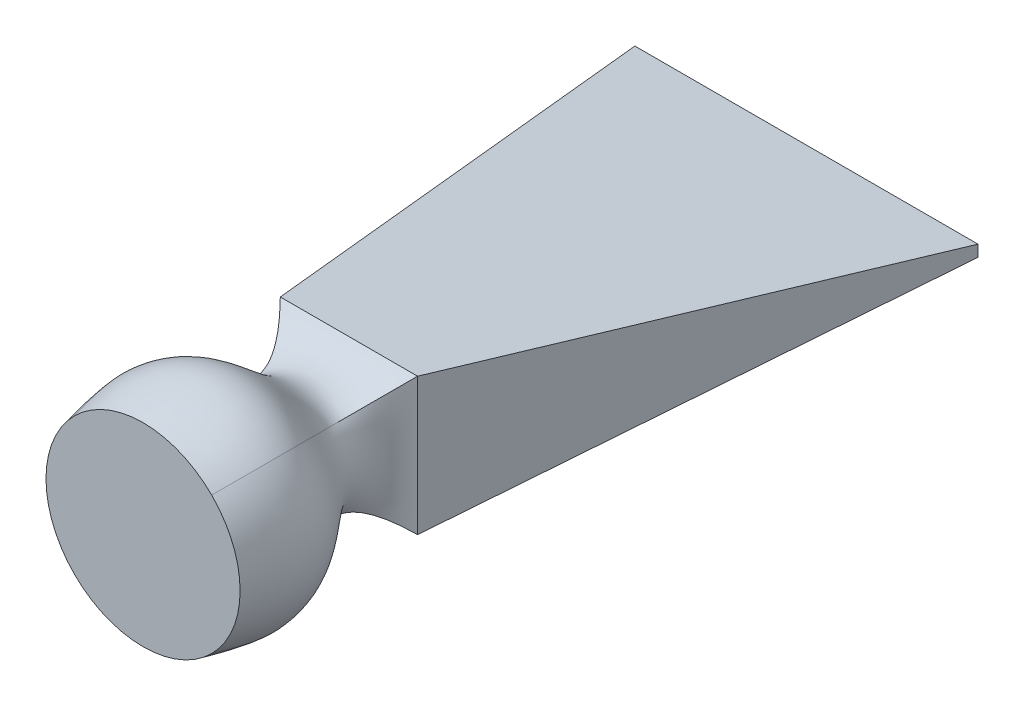
ISO-10303-21;
HEADER;
FILE_DESCRIPTION(('STEP AP214'),'2;1');
FILE_NAME('part.step','',(''),(''),'','','');
FILE_SCHEMA(('AUTOMOTIVE_DESIGN { 1 0 10303 214 1 1 1 1 }'));
ENDSEC;
DATA;
#1=APPLICATION_CONTEXT('core data for automotive mechanical design processes');
#2=APPLICATION_PROTOCOL_DEFINITION('international standard','automotive_design',2000,#1);
#3=PRODUCT_CONTEXT('',#1,'mechanical');
#4=PRODUCT('Part','Part','',(#3));
#5=PRODUCT_RELATED_PRODUCT_CATEGORY('part','',(#4));
#6=PRODUCT_DEFINITION_FORMATION('','',#4);
#7=PRODUCT_DEFINITION_CONTEXT('part definition',#1,'design');
#8=PRODUCT_DEFINITION('design','',#6,#7);
#9=PRODUCT_DEFINITION_SHAPE('','',#8);
#10=(LENGTH_UNIT() NAMED_UNIT(*) SI_UNIT(.MILLI.,.METRE.));
#11=(NAMED_UNIT(*) PLANE_ANGLE_UNIT() SI_UNIT($,.RADIAN.));
#12=(NAMED_UNIT(*) SI_UNIT($,.STERADIAN.) SOLID_ANGLE_UNIT());
#13=UNCERTAINTY_MEASURE_WITH_UNIT(LENGTH_MEASURE(1.E-05),#10,'distance_accuracy_value','');
#14=(GEOMETRIC_REPRESENTATION_CONTEXT(3) GLOBAL_UNCERTAINTY_ASSIGNED_CONTEXT((#13)) GLOBAL_UNIT_ASSIGNED_CONTEXT((#10,
#11,#12)) REPRESENTATION_CONTEXT('',''));
#15=CARTESIAN_POINT('',(0.,0.,0.));
#16=DIRECTION('',(0.,0.,1.));
#17=DIRECTION('',(1.,0.,0.));
#18=AXIS2_PLACEMENT_3D('',#15,#16,#17);
#19=CARTESIAN_POINT('',(0.,0.,90.));
#20=DIRECTION('',(0.,0.,1.));
#21=DIRECTION('',(1.,0.,0.));
#22=AXIS2_PLACEMENT_3D('',#19,#20,#21);
#23=PLANE('',#22);
#24=CARTESIAN_POINT('',(0.,0.,90.));
#25=DIRECTION('',(0.,0.,1.));
#26=DIRECTION('',(1.,0.,0.));
#27=AXIS2_PLACEMENT_3D('',#24,#25,#26);
#28=CIRCLE('',#27,42.4264068711929);
#29=CARTESIAN_POINT('',(30.,-30.,90.));
#30=VERTEX_POINT('',#29);
#31=CARTESIAN_POINT('',(30.,30.,90.));
#32=VERTEX_POINT('',#31);
#33=EDGE_CURVE('E12',#30,#32,#28,.T.);
#34=ORIENTED_EDGE('',*,*,#33,.T.);
#35=CARTESIAN_POINT('',(-30.,30.,90.));
#36=VERTEX_POINT('',#35);
#37=EDGE_CURVE('E80',#32,#36,#28,.T.);
#38=ORIENTED_EDGE('',*,*,#37,.T.);
#39=CARTESIAN_POINT('',(-30.,-30.,90.));
#40=VERTEX_POINT('',#39);
#41=EDGE_CURVE('E328',#36,#40,#28,.T.);
#42=ORIENTED_EDGE('',*,*,#41,.T.);
#43=EDGE_CURVE('E246',#40,#30,#28,.T.);
#44=ORIENTED_EDGE('',*,*,#43,.T.);
#45=EDGE_LOOP('',(#34,#38,#42,#44));
#46=FACE_BOUND('',#45,.T.);
#47=ADVANCED_FACE('F71',(#46),#23,.T.);
#48=CARTESIAN_POINT('',(30.,30.,0.));
#49=CARTESIAN_POINT('',(21.7851130197758,21.7851130197758,8.33333333333334));
#50=CARTESIAN_POINT('',(11.4480792780272,11.4480792780272,26.6842583231321));
#51=CARTESIAN_POINT('',(36.5877389212421,36.5877389212421,50.9567471285879));
#52=CARTESIAN_POINT('',(32.3581604097574,32.3581604097574,75.7725733783253));
#53=CARTESIAN_POINT('',(30.,30.,90.));
#54=CARTESIAN_POINT('',(10.,30.,0.));
#55=CARTESIAN_POINT('',(7.26170433992526,21.7851130197758,8.33333333333334));
#56=CARTESIAN_POINT('',(6.36969580298355,23.7303286113224,26.6842583231321));
#57=CARTESIAN_POINT('',(15.9903753094837,54.8377649087592,50.9567471285879));
#58=CARTESIAN_POINT('',(14.2286031722261,48.9156107074504,75.7725733783253));
#59=CARTESIAN_POINT('',(13.442549702307,46.557450297693,90.));
#60=CARTESIAN_POINT('',(-10.,30.,0.));
#61=CARTESIAN_POINT('',(-7.26170433992527,21.7851130197758,8.33333333333334));
#62=CARTESIAN_POINT('',(-6.36969580298355,23.7303286113224,26.6842583231321));
#63=CARTESIAN_POINT('',(-15.9903753094837,54.8377649087592,50.9567471285879));
#64=CARTESIAN_POINT('',(-14.2286031722261,48.9156107074504,75.7725733783253));
#65=CARTESIAN_POINT('',(-13.442549702307,46.557450297693,90.));
#66=CARTESIAN_POINT('',(-30.,30.,0.));
#67=CARTESIAN_POINT('',(-21.7851130197758,21.7851130197758,8.33333333333334));
#68=CARTESIAN_POINT('',(-11.4480792780272,11.4480792780272,26.6842583231321));
#69=CARTESIAN_POINT('',(-36.5877389212421,36.5877389212421,50.9567471285879));
#70=CARTESIAN_POINT('',(-32.3581604097574,32.3581604097574,75.7725733783253));
#71=CARTESIAN_POINT('',(-30.,30.,90.));
#72=B_SPLINE_SURFACE_WITH_KNOTS('',3,3,((#48,#49,#50,#51,#52,#53),(#54,#55,#56,#57,#58,#59),
(#60,#61,#62,#63,#64,#65),(#66,#67,#68,#69,#70,#71)),.UNSPECIFIED.,.F.,.F.,.F.,(4,4),(4,1,1,4),
(0.,1.),(0.,0.284226887704337,0.593739185555325,1.),.UNSPECIFIED.);
#73=DIRECTION('',(-1.,0.,0.));
#74=VECTOR('',#73,1.);
#75=CARTESIAN_POINT('',(-30.,30.,0.));
#76=LINE('',#75,#74);
#77=CARTESIAN_POINT('',(30.,30.,0.));
#78=VERTEX_POINT('',#77);
#79=CARTESIAN_POINT('',(-30.,30.,0.));
#80=VERTEX_POINT('',#79);
#81=EDGE_CURVE('E369',#78,#80,#76,.T.);
#82=CARTESIAN_POINT('',(-30.,30.,0.));
#83=CARTESIAN_POINT('',(-21.7851130197758,21.7851130197758,8.33333333333334));
#84=CARTESIAN_POINT('',(-11.4480792780272,11.4480792780272,26.6842583231321));
#85=CARTESIAN_POINT('',(-36.5877389212421,36.5877389212421,50.9567471285879));
#86=CARTESIAN_POINT('',(-32.3581604097574,32.3581604097574,75.7725733783253));
#87=CARTESIAN_POINT('',(-30.,30.,90.));
#88=B_SPLINE_CURVE_WITH_KNOTS('',3,(#82,#83,#84,#85,#86,#87),.UNSPECIFIED.,.F.,.F.,(4,1,1,4),
(0.,0.284226887704337,0.593739185555325,1.),.UNSPECIFIED.);
#89=EDGE_CURVE('E237',#80,#36,#88,.T.);
#90=CARTESIAN_POINT('',(30.,30.,0.));
#91=CARTESIAN_POINT('',(21.7851130197758,21.7851130197758,8.33333333333334));
#92=CARTESIAN_POINT('',(11.4480792780272,11.4480792780272,26.6842583231321));
#93=CARTESIAN_POINT('',(36.5877389212421,36.5877389212421,50.9567471285879));
#94=CARTESIAN_POINT('',(32.3581604097574,32.3581604097574,75.7725733783253));
#95=CARTESIAN_POINT('',(30.,30.,90.));
#96=B_SPLINE_CURVE_WITH_KNOTS('',3,(#90,#91,#92,#93,#94,#95),.UNSPECIFIED.,.F.,.F.,(4,1,1,4),
(0.,0.284226887704337,0.593739185555325,1.),.UNSPECIFIED.);
#97=EDGE_CURVE('E251',#32,#78,#96,.F.);
#98=ORIENTED_EDGE('',*,*,#81,.T.);
#99=ORIENTED_EDGE('',*,*,#89,.T.);
#100=ORIENTED_EDGE('',*,*,#37,.F.);
#101=ORIENTED_EDGE('',*,*,#97,.T.);
#102=EDGE_LOOP('',(#98,#99,#100,#101));
#103=FACE_BOUND('',#102,.T.);
#104=ADVANCED_FACE('F379',(#103),#72,.T.);
#105=CARTESIAN_POINT('',(-30.,30.,0.));
#106=CARTESIAN_POINT('',(-21.7851130197758,21.7851130197758,8.33333333333334));
#107=CARTESIAN_POINT('',(-11.4480792780272,11.4480792780272,26.6842583231321));
#108=CARTESIAN_POINT('',(-36.5877389212421,36.5877389212421,50.9567471285879));
#109=CARTESIAN_POINT('',(-32.3581604097574,32.3581604097574,75.7725733783253));
#110=CARTESIAN_POINT('',(-30.,30.,90.));
#111=CARTESIAN_POINT('',(-30.,10.,0.));
#112=CARTESIAN_POINT('',(-21.7851130197758,7.26170433992527,8.33333333333334));
#113=CARTESIAN_POINT('',(-23.7303286113224,6.36969580298356,26.6842583231321));
#114=CARTESIAN_POINT('',(-54.8377649087592,15.9903753094837,50.9567471285879));
#115=CARTESIAN_POINT('',(-48.9156107074504,14.2286031722261,75.7725733783253));
#116=CARTESIAN_POINT('',(-46.557450297693,13.442549702307,90.));
#117=CARTESIAN_POINT('',(-30.,-10.,0.));
#118=CARTESIAN_POINT('',(-21.7851130197758,-7.26170433992526,8.33333333333334));
#119=CARTESIAN_POINT('',(-23.7303286113224,-6.36969580298354,26.6842583231321));
#120=CARTESIAN_POINT('',(-54.8377649087592,-15.9903753094837,50.9567471285879));
#121=CARTESIAN_POINT('',(-48.9156107074504,-14.2286031722261,75.7725733783253));
#122=CARTESIAN_POINT('',(-46.557450297693,-13.442549702307,90.));
#123=CARTESIAN_POINT('',(-30.,-30.,0.));
#124=CARTESIAN_POINT('',(-21.7851130197758,-21.7851130197758,8.33333333333334));
#125=CARTESIAN_POINT('',(-11.4480792780272,-11.4480792780272,26.6842583231321));
#126=CARTESIAN_POINT('',(-36.5877389212421,-36.5877389212421,50.9567471285879));
#127=CARTESIAN_POINT('',(-32.3581604097574,-32.3581604097574,75.7725733783253));
#128=CARTESIAN_POINT('',(-30.,-30.,90.));
#129=B_SPLINE_SURFACE_WITH_KNOTS('',3,3,((#105,#106,#107,#108,#109,#110),(#111,#112,#113,#114,
#115,#116),(#117,#118,#119,#120,#121,#122),(#123,#124,#125,#126,#127,#128)),.UNSPECIFIED.,.F.,
.F.,.F.,(4,4),(4,1,1,4),(0.,1.),(0.,0.284226887704337,0.593739185555325,1.),.UNSPECIFIED.);
#130=DIRECTION('',(0.,-1.,0.));
#131=VECTOR('',#130,1.);
#132=CARTESIAN_POINT('',(-30.,-30.,0.));
#133=LINE('',#132,#131);
#134=CARTESIAN_POINT('',(-30.,-30.,0.));
#135=VERTEX_POINT('',#134);
#136=EDGE_CURVE('E155',#80,#135,#133,.T.);
#137=CARTESIAN_POINT('',(-30.,-30.,0.));
#138=CARTESIAN_POINT('',(-21.7851130197758,-21.7851130197758,8.33333333333334));
#139=CARTESIAN_POINT('',(-11.4480792780272,-11.4480792780272,26.6842583231321));
#140=CARTESIAN_POINT('',(-36.5877389212421,-36.5877389212421,50.9567471285879));
#141=CARTESIAN_POINT('',(-32.3581604097574,-32.3581604097574,75.7725733783253));
#142=CARTESIAN_POINT('',(-30.,-30.,90.));
#143=B_SPLINE_CURVE_WITH_KNOTS('',3,(#137,#138,#139,#140,#141,#142),.UNSPECIFIED.,.F.,.F.,(4,1,
1,4),(0.,0.284226887704337,0.593739185555325,1.),.UNSPECIFIED.);
#144=EDGE_CURVE('E228',#135,#40,#143,.T.);
#145=ORIENTED_EDGE('',*,*,#136,.T.);
#146=ORIENTED_EDGE('',*,*,#144,.T.);
#147=ORIENTED_EDGE('',*,*,#41,.F.);
#148=ORIENTED_EDGE('',*,*,#89,.F.);
#149=EDGE_LOOP('',(#145,#146,#147,#148));
#150=FACE_BOUND('',#149,.T.);
#151=ADVANCED_FACE('F304',(#150),#129,.T.);
#152=CARTESIAN_POINT('',(30.,-30.,0.));
#153=CARTESIAN_POINT('',(21.7851130197758,-21.7851130197758,8.33333333333334));
#154=CARTESIAN_POINT('',(11.4480792780272,-11.4480792780272,26.6842583231321));
#155=CARTESIAN_POINT('',(36.5877389212421,-36.5877389212421,50.9567471285879));
#156=CARTESIAN_POINT('',(32.3581604097574,-32.3581604097574,75.7725733783253));
#157=CARTESIAN_POINT('',(30.,-30.,90.));
#158=CARTESIAN_POINT('',(30.,-10.,0.));
#159=CARTESIAN_POINT('',(21.7851130197758,-7.26170433992527,8.33333333333334));
#160=CARTESIAN_POINT('',(23.7303286113224,-6.36969580298355,26.6842583231321));
#161=CARTESIAN_POINT('',(54.8377649087593,-15.9903753094837,50.9567471285879));
#162=CARTESIAN_POINT('',(48.9156107074504,-14.2286031722261,75.7725733783253));
#163=CARTESIAN_POINT('',(46.557450297693,-13.442549702307,90.));
#164=CARTESIAN_POINT('',(30.,10.,0.));
#165=CARTESIAN_POINT('',(21.7851130197758,7.26170433992526,8.33333333333334));
#166=CARTESIAN_POINT('',(23.7303286113224,6.36969580298354,26.6842583231321));
#167=CARTESIAN_POINT('',(54.8377649087593,15.9903753094837,50.9567471285879));
#168=CARTESIAN_POINT('',(48.9156107074504,14.2286031722261,75.7725733783253));
#169=CARTESIAN_POINT('',(46.557450297693,13.442549702307,90.));
#170=CARTESIAN_POINT('',(30.,30.,0.));
#171=CARTESIAN_POINT('',(21.7851130197758,21.7851130197758,8.33333333333334));
#172=CARTESIAN_POINT('',(11.4480792780272,11.4480792780272,26.6842583231321));
#173=CARTESIAN_POINT('',(36.5877389212421,36.5877389212421,50.9567471285879));
#174=CARTESIAN_POINT('',(32.3581604097574,32.3581604097574,75.7725733783253));
#175=CARTESIAN_POINT('',(30.,30.,90.));
#176=B_SPLINE_SURFACE_WITH_KNOTS('',3,3,((#152,#153,#154,#155,#156,#157),(#158,#159,#160,#161,
#162,#163),(#164,#165,#166,#167,#168,#169),(#170,#171,#172,#173,#174,#175)),.UNSPECIFIED.,.F.,
.F.,.F.,(4,4),(4,1,1,4),(0.,1.),(0.,0.284226887704337,0.593739185555325,1.),.UNSPECIFIED.);
#177=DIRECTION('',(0.,1.,0.));
#178=VECTOR('',#177,1.);
#179=CARTESIAN_POINT('',(30.,-30.,0.));
#180=LINE('',#179,#178);
#181=CARTESIAN_POINT('',(30.,-30.,0.));
#182=VERTEX_POINT('',#181);
#183=EDGE_CURVE('E169',#182,#78,#180,.T.);
#184=CARTESIAN_POINT('',(30.,-30.,0.));
#185=CARTESIAN_POINT('',(21.7851130197758,-21.7851130197758,8.33333333333334));
#186=CARTESIAN_POINT('',(11.4480792780272,-11.4480792780272,26.6842583231321));
#187=CARTESIAN_POINT('',(36.5877389212421,-36.5877389212421,50.9567471285879));
#188=CARTESIAN_POINT('',(32.3581604097574,-32.3581604097574,75.7725733783253));
#189=CARTESIAN_POINT('',(30.,-30.,90.));
#190=B_SPLINE_CURVE_WITH_KNOTS('',3,(#184,#185,#186,#187,#188,#189),.UNSPECIFIED.,.F.,.F.,(4,1,
1,4),(0.,0.284226887704337,0.593739185555325,1.),.UNSPECIFIED.);
#191=EDGE_CURVE('E236',#182,#30,#190,.T.);
#192=ORIENTED_EDGE('',*,*,#183,.T.);
#193=ORIENTED_EDGE('',*,*,#97,.F.);
#194=ORIENTED_EDGE('',*,*,#33,.F.);
#195=ORIENTED_EDGE('',*,*,#191,.F.);
#196=EDGE_LOOP('',(#192,#193,#194,#195));
#197=FACE_BOUND('',#196,.T.);
#198=ADVANCED_FACE('F293',(#197),#176,.T.);
#199=CARTESIAN_POINT('',(-30.,-30.,0.));
#200=CARTESIAN_POINT('',(-21.7851130197758,-21.7851130197758,8.33333333333334));
#201=CARTESIAN_POINT('',(-11.4480792780272,-11.4480792780272,26.6842583231321));
#202=CARTESIAN_POINT('',(-36.5877389212421,-36.5877389212421,50.9567471285879));
#203=CARTESIAN_POINT('',(-32.3581604097574,-32.3581604097574,75.7725733783253));
#204=CARTESIAN_POINT('',(-30.,-30.,90.));
#205=CARTESIAN_POINT('',(-10.,-30.,0.));
#206=CARTESIAN_POINT('',(-7.26170433992527,-21.7851130197758,8.33333333333334));
#207=CARTESIAN_POINT('',(-6.36969580298355,-23.7303286113224,26.6842583231321));
#208=CARTESIAN_POINT('',(-15.9903753094837,-54.8377649087593,50.9567471285879));
#209=CARTESIAN_POINT('',(-14.2286031722261,-48.9156107074504,75.7725733783253));
#210=CARTESIAN_POINT('',(-13.442549702307,-46.557450297693,90.));
#211=CARTESIAN_POINT('',(10.,-30.,0.));
#212=CARTESIAN_POINT('',(7.26170433992526,-21.7851130197758,8.33333333333334));
#213=CARTESIAN_POINT('',(6.36969580298354,-23.7303286113224,26.6842583231321));
#214=CARTESIAN_POINT('',(15.9903753094837,-54.8377649087593,50.9567471285879));
#215=CARTESIAN_POINT('',(14.2286031722261,-48.9156107074504,75.7725733783253));
#216=CARTESIAN_POINT('',(13.442549702307,-46.557450297693,90.));
#217=CARTESIAN_POINT('',(30.,-30.,0.));
#218=CARTESIAN_POINT('',(21.7851130197758,-21.7851130197758,8.33333333333334));
#219=CARTESIAN_POINT('',(11.4480792780272,-11.4480792780272,26.6842583231321));
#220=CARTESIAN_POINT('',(36.5877389212421,-36.5877389212421,50.9567471285879));
#221=CARTESIAN_POINT('',(32.3581604097574,-32.3581604097574,75.7725733783253));
#222=CARTESIAN_POINT('',(30.,-30.,90.));
#223=B_SPLINE_SURFACE_WITH_KNOTS('',3,3,((#199,#200,#201,#202,#203,#204),(#205,#206,#207,#208,
#209,#210),(#211,#212,#213,#214,#215,#216),(#217,#218,#219,#220,#221,#222)),.UNSPECIFIED.,.F.,
.F.,.F.,(4,4),(4,1,1,4),(0.,1.),(0.,0.284226887704337,0.593739185555325,1.),.UNSPECIFIED.);
#224=DIRECTION('',(1.,0.,0.));
#225=VECTOR('',#224,1.);
#226=CARTESIAN_POINT('',(-30.,-30.,0.));
#227=LINE('',#226,#225);
#228=EDGE_CURVE('E257',#135,#182,#227,.T.);
#229=ORIENTED_EDGE('',*,*,#228,.T.);
#230=ORIENTED_EDGE('',*,*,#191,.T.);
#231=ORIENTED_EDGE('',*,*,#43,.F.);
#232=ORIENTED_EDGE('',*,*,#144,.F.);
#233=EDGE_LOOP('',(#229,#230,#231,#232));
#234=FACE_BOUND('',#233,.T.);
#235=ADVANCED_FACE('F282',(#234),#223,.T.);
#236=CARTESIAN_POINT('',(0.,0.,-200.));
#237=DIRECTION('',(0.,0.,1.));
#238=DIRECTION('',(1.,0.,0.));
#239=AXIS2_PLACEMENT_3D('',#236,#237,#238);
#240=PLANE('',#239);
#241=DIRECTION('',(-1.,0.,0.));
#242=VECTOR('',#241,1.);
#243=CARTESIAN_POINT('',(-75.,2.5,-200.));
#244=LINE('',#243,#242);
#245=CARTESIAN_POINT('',(75.,2.5,-200.));
#246=VERTEX_POINT('',#245);
#247=CARTESIAN_POINT('',(-75.,2.5,-200.));
#248=VERTEX_POINT('',#247);
#249=EDGE_CURVE('E130',#246,#248,#244,.T.);
#250=ORIENTED_EDGE('',*,*,#249,.F.);
#251=DIRECTION('',(0.,1.,0.));
#252=VECTOR('',#251,1.);
#253=CARTESIAN_POINT('',(75.,-2.5,-200.));
#254=LINE('',#253,#252);
#255=CARTESIAN_POINT('',(75.,-2.5,-200.));
#256=VERTEX_POINT('',#255);
#257=EDGE_CURVE('E149',#256,#246,#254,.T.);
#258=ORIENTED_EDGE('',*,*,#257,.F.);
#259=DIRECTION('',(1.,0.,0.));
#260=VECTOR('',#259,1.);
#261=CARTESIAN_POINT('',(-75.,-2.5,-200.));
#262=LINE('',#261,#260);
#263=CARTESIAN_POINT('',(-75.,-2.5,-200.));
#264=VERTEX_POINT('',#263);
#265=EDGE_CURVE('E132',#264,#256,#262,.T.);
#266=ORIENTED_EDGE('',*,*,#265,.F.);
#267=DIRECTION('',(0.,-1.,0.));
#268=VECTOR('',#267,1.);
#269=CARTESIAN_POINT('',(-75.,2.5,-200.));
#270=LINE('',#269,#268);
#271=EDGE_CURVE('E125',#248,#264,#270,.T.);
#272=ORIENTED_EDGE('',*,*,#271,.F.);
#273=EDGE_LOOP('',(#250,#258,#266,#272));
#274=FACE_BOUND('',#273,.T.);
#275=ADVANCED_FACE('F128',(#274),#240,.F.);
#276=CARTESIAN_POINT('',(-28.5544318857823,0.,6.42474717430101));
#277=DIRECTION('',(-0.975609756097561,0.,0.219512195121951));
#278=DIRECTION('',(0.219512195121951,0.,0.975609756097561));
#279=AXIS2_PLACEMENT_3D('',#276,#277,#278);
#280=PLANE('',#279);
#281=DIRECTION('',(-0.217563370783763,-0.132955393256744,-0.966948314594504));
#282=VECTOR('',#281,1.);
#283=CARTESIAN_POINT('',(-30.,30.,0.));
#284=LINE('',#283,#282);
#285=EDGE_CURVE('E138',#80,#248,#284,.T.);
#286=ORIENTED_EDGE('',*,*,#285,.T.);
#287=ORIENTED_EDGE('',*,*,#271,.T.);
#288=DIRECTION('',(-0.217563370783763,0.132955393256744,-0.966948314594504));
#289=VECTOR('',#288,1.);
#290=CARTESIAN_POINT('',(-30.,-30.,0.));
#291=LINE('',#290,#289);
#292=EDGE_CURVE('E157',#135,#264,#291,.T.);
#293=ORIENTED_EDGE('',*,*,#292,.F.);
#294=ORIENTED_EDGE('',*,*,#136,.F.);
#295=EDGE_LOOP('',(#286,#287,#293,#294));
#296=FACE_BOUND('',#295,.T.);
#297=ADVANCED_FACE('F153',(#296),#280,.T.);
#298=CARTESIAN_POINT('',(0.,-29.4433369115166,-4.04845882533354));
#299=DIRECTION('',(0.,-0.990678839845296,-0.136218340478728));
#300=DIRECTION('',(0.,0.136218340478728,-0.990678839845296));
#301=AXIS2_PLACEMENT_3D('',#298,#299,#300);
#302=PLANE('',#301);
#303=ORIENTED_EDGE('',*,*,#292,.T.);
#304=ORIENTED_EDGE('',*,*,#265,.T.);
#305=DIRECTION('',(0.217563370783763,0.132955393256744,-0.966948314594504));
#306=VECTOR('',#305,1.);
#307=CARTESIAN_POINT('',(30.,-30.,0.));
#308=LINE('',#307,#306);
#309=EDGE_CURVE('E166',#182,#256,#308,.T.);
#310=ORIENTED_EDGE('',*,*,#309,.F.);
#311=ORIENTED_EDGE('',*,*,#228,.F.);
#312=EDGE_LOOP('',(#303,#304,#310,#311));
#313=FACE_BOUND('',#312,.T.);
#314=ADVANCED_FACE('F185',(#313),#302,.T.);
#315=CARTESIAN_POINT('',(0.,29.4433369115166,-4.04845882533354));
#316=DIRECTION('',(0.,0.990678839845296,-0.136218340478728));
#317=DIRECTION('',(0.,0.136218340478728,0.990678839845296));
#318=AXIS2_PLACEMENT_3D('',#315,#316,#317);
#319=PLANE('',#318);
#320=DIRECTION('',(0.217563370783763,-0.132955393256744,-0.966948314594504));
#321=VECTOR('',#320,1.);
#322=CARTESIAN_POINT('',(30.,30.,0.));
#323=LINE('',#322,#321);
#324=EDGE_CURVE('E148',#78,#246,#323,.T.);
#325=ORIENTED_EDGE('',*,*,#324,.T.);
#326=ORIENTED_EDGE('',*,*,#249,.T.);
#327=ORIENTED_EDGE('',*,*,#285,.F.);
#328=ORIENTED_EDGE('',*,*,#81,.F.);
#329=EDGE_LOOP('',(#325,#326,#327,#328));
#330=FACE_BOUND('',#329,.T.);
#331=ADVANCED_FACE('F145',(#330),#319,.T.);
#332=CARTESIAN_POINT('',(28.5544318857823,0.,6.42474717430101));
#333=DIRECTION('',(0.975609756097561,0.,0.219512195121951));
#334=DIRECTION('',(0.219512195121951,0.,-0.975609756097561));
#335=AXIS2_PLACEMENT_3D('',#332,#333,#334);
#336=PLANE('',#335);
#337=ORIENTED_EDGE('',*,*,#309,.T.);
#338=ORIENTED_EDGE('',*,*,#257,.T.);
#339=ORIENTED_EDGE('',*,*,#324,.F.);
#340=ORIENTED_EDGE('',*,*,#183,.F.);
#341=EDGE_LOOP('',(#337,#338,#339,#340));
#342=FACE_BOUND('',#341,.T.);
#343=ADVANCED_FACE('F384',(#342),#336,.T.);
#344=CLOSED_SHELL('',(#47,#104,#151,#198,#235,#275,#297,#314,#331,#343));
#345=MANIFOLD_SOLID_BREP('B2',#344);
#346=ADVANCED_BREP_SHAPE_REPRESENTATION('',(#18,#345),#14);
#347=SHAPE_DEFINITION_REPRESENTATION(#9,#346);
ENDSEC;
END-ISO-10303-21;
